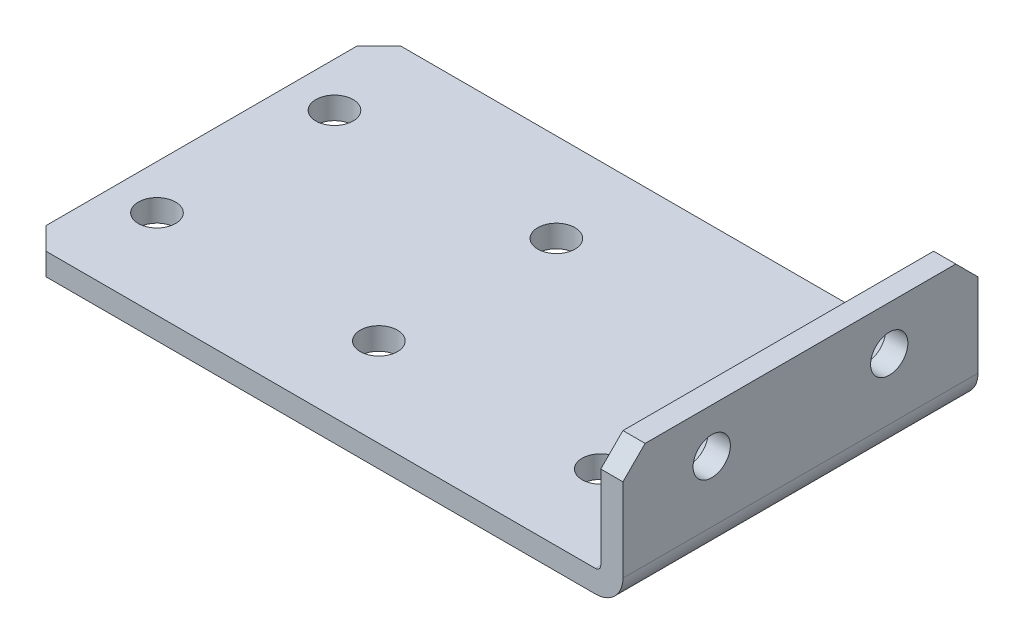
ISO-10303-21;
HEADER;
FILE_DESCRIPTION(('STEP AP214'),'2;1');
FILE_NAME('part.step','',(''),(''),'','','');
FILE_SCHEMA(('AUTOMOTIVE_DESIGN { 1 0 10303 214 1 1 1 1 }'));
ENDSEC;
DATA;
#1=APPLICATION_CONTEXT('core data for automotive mechanical design processes');
#2=APPLICATION_PROTOCOL_DEFINITION('international standard','automotive_design',2000,#1);
#3=PRODUCT_CONTEXT('',#1,'mechanical');
#4=PRODUCT('Part','Part','',(#3));
#5=PRODUCT_RELATED_PRODUCT_CATEGORY('part','',(#4));
#6=PRODUCT_DEFINITION_FORMATION('','',#4);
#7=PRODUCT_DEFINITION_CONTEXT('part definition',#1,'design');
#8=PRODUCT_DEFINITION('design','',#6,#7);
#9=PRODUCT_DEFINITION_SHAPE('','',#8);
#10=(LENGTH_UNIT() NAMED_UNIT(*) SI_UNIT(.MILLI.,.METRE.));
#11=(NAMED_UNIT(*) PLANE_ANGLE_UNIT() SI_UNIT($,.RADIAN.));
#12=(NAMED_UNIT(*) SI_UNIT($,.STERADIAN.) SOLID_ANGLE_UNIT());
#13=UNCERTAINTY_MEASURE_WITH_UNIT(LENGTH_MEASURE(1.E-05),#10,'distance_accuracy_value','');
#14=(GEOMETRIC_REPRESENTATION_CONTEXT(3) GLOBAL_UNCERTAINTY_ASSIGNED_CONTEXT((#13)) GLOBAL_UNIT_ASSIGNED_CONTEXT((#10,
#11,#12)) REPRESENTATION_CONTEXT('',''));
#15=CARTESIAN_POINT('',(0.,0.,0.));
#16=DIRECTION('',(0.,0.,1.));
#17=DIRECTION('',(1.,0.,0.));
#18=AXIS2_PLACEMENT_3D('',#15,#16,#17);
#19=CARTESIAN_POINT('',(0.,3.175,-63.5));
#20=DIRECTION('',(0.,0.,1.));
#21=DIRECTION('',(-1.,0.,0.));
#22=AXIS2_PLACEMENT_3D('',#19,#20,#21);
#23=PLANE('',#22);
#24=DIRECTION('',(1.,0.,0.));
#25=VECTOR('',#24,1.);
#26=CARTESIAN_POINT('',(0.,0.,-63.5));
#27=LINE('',#26,#25);
#28=CARTESIAN_POINT('',(81.788,0.,-63.5));
#29=VERTEX_POINT('',#28);
#30=CARTESIAN_POINT('',(3.17500000000001,0.,-63.5));
#31=VERTEX_POINT('',#30);
#32=EDGE_CURVE('E164',#29,#31,#27,.F.);
#33=ORIENTED_EDGE('',*,*,#32,.T.);
#34=DIRECTION('',(0.,-1.,0.));
#35=VECTOR('',#34,1.);
#36=CARTESIAN_POINT('',(3.17500000000001,3.175,-63.5));
#37=LINE('',#36,#35);
#38=CARTESIAN_POINT('',(3.17500000000001,3.175,-63.5));
#39=VERTEX_POINT('',#38);
#40=EDGE_CURVE('E193',#31,#39,#37,.F.);
#41=ORIENTED_EDGE('',*,*,#40,.T.);
#42=DIRECTION('',(-1.,0.,0.));
#43=VECTOR('',#42,1.);
#44=CARTESIAN_POINT('',(0.,3.175,-63.5));
#45=LINE('',#44,#43);
#46=CARTESIAN_POINT('',(81.788,3.175,-63.5));
#47=VERTEX_POINT('',#46);
#48=EDGE_CURVE('E177',#47,#39,#45,.T.);
#49=ORIENTED_EDGE('',*,*,#48,.F.);
#50=DIRECTION('',(0.,1.,0.));
#51=VECTOR('',#50,1.);
#52=CARTESIAN_POINT('',(81.788,3.175,-63.5));
#53=LINE('',#52,#51);
#54=EDGE_CURVE('E173',#29,#47,#53,.T.);
#55=ORIENTED_EDGE('',*,*,#54,.F.);
#56=EDGE_LOOP('',(#33,#41,#49,#55));
#57=FACE_BOUND('',#56,.T.);
#58=ADVANCED_FACE('F54',(#57),#23,.F.);
#59=CARTESIAN_POINT('',(0.,3.175,0.));
#60=DIRECTION('',(1.,0.,0.));
#61=DIRECTION('',(0.,0.,1.));
#62=AXIS2_PLACEMENT_3D('',#59,#60,#61);
#63=PLANE('',#62);
#64=DIRECTION('',(0.,0.,1.));
#65=VECTOR('',#64,1.);
#66=CARTESIAN_POINT('',(0.,3.175,0.));
#67=LINE('',#66,#65);
#68=CARTESIAN_POINT('',(0.,3.175,-60.325));
#69=VERTEX_POINT('',#68);
#70=CARTESIAN_POINT('',(0.,3.175,-15.875));
#71=VERTEX_POINT('',#70);
#72=EDGE_CURVE('E168',#69,#71,#67,.T.);
#73=ORIENTED_EDGE('',*,*,#72,.F.);
#74=DIRECTION('',(0.,1.,0.));
#75=VECTOR('',#74,1.);
#76=CARTESIAN_POINT('',(0.,3.175,-60.325));
#77=LINE('',#76,#75);
#78=CARTESIAN_POINT('',(0.,0.,-60.325));
#79=VERTEX_POINT('',#78);
#80=EDGE_CURVE('E202',#69,#79,#77,.F.);
#81=ORIENTED_EDGE('',*,*,#80,.T.);
#82=DIRECTION('',(0.,0.,-1.));
#83=VECTOR('',#82,1.);
#84=CARTESIAN_POINT('',(0.,0.,-63.5));
#85=LINE('',#84,#83);
#86=CARTESIAN_POINT('',(0.,0.,-15.875));
#87=VERTEX_POINT('',#86);
#88=EDGE_CURVE('E166',#79,#87,#85,.F.);
#89=ORIENTED_EDGE('',*,*,#88,.T.);
#90=DIRECTION('',(0.,-1.,0.));
#91=VECTOR('',#90,1.);
#92=CARTESIAN_POINT('',(0.,3.175,-15.875));
#93=LINE('',#92,#91);
#94=EDGE_CURVE('E200',#87,#71,#93,.F.);
#95=ORIENTED_EDGE('',*,*,#94,.T.);
#96=EDGE_LOOP('',(#73,#81,#89,#95));
#97=FACE_BOUND('',#96,.T.);
#98=ADVANCED_FACE('F221',(#97),#63,.F.);
#99=CARTESIAN_POINT('',(0.,3.175,-63.5));
#100=DIRECTION('',(0.,-1.,0.));
#101=DIRECTION('',(0.,0.,-1.));
#102=AXIS2_PLACEMENT_3D('',#99,#100,#101);
#103=PLANE('',#102);
#104=CARTESIAN_POINT('',(38.1,3.175,-25.4));
#105=DIRECTION('',(0.,1.,0.));
#106=DIRECTION('',(0.,0.,1.));
#107=AXIS2_PLACEMENT_3D('',#104,#105,#106);
#108=CIRCLE('',#107,2.667);
#109=CARTESIAN_POINT('',(38.1,3.175,-22.733));
#110=VERTEX_POINT('',#109);
#111=EDGE_CURVE('E280',#110,#110,#108,.T.);
#112=ORIENTED_EDGE('',*,*,#111,.F.);
#113=EDGE_LOOP('',(#112));
#114=FACE_BOUND('',#113,.T.);
#115=CARTESIAN_POINT('',(38.1,3.175,-50.8));
#116=DIRECTION('',(0.,1.,0.));
#117=DIRECTION('',(0.,0.,1.));
#118=AXIS2_PLACEMENT_3D('',#115,#116,#117);
#119=CIRCLE('',#118,2.667);
#120=CARTESIAN_POINT('',(38.1,3.175,-48.133));
#121=VERTEX_POINT('',#120);
#122=EDGE_CURVE('E274',#121,#121,#119,.T.);
#123=ORIENTED_EDGE('',*,*,#122,.F.);
#124=EDGE_LOOP('',(#123));
#125=FACE_BOUND('',#124,.T.);
#126=CARTESIAN_POINT('',(69.85,3.175,-25.4));
#127=DIRECTION('',(0.,1.,0.));
#128=DIRECTION('',(0.,0.,1.));
#129=AXIS2_PLACEMENT_3D('',#126,#127,#128);
#130=CIRCLE('',#129,2.667);
#131=CARTESIAN_POINT('',(69.85,3.175,-22.733));
#132=VERTEX_POINT('',#131);
#133=EDGE_CURVE('E268',#132,#132,#130,.T.);
#134=ORIENTED_EDGE('',*,*,#133,.F.);
#135=EDGE_LOOP('',(#134));
#136=FACE_BOUND('',#135,.T.);
#137=CARTESIAN_POINT('',(69.85,3.175,-50.8));
#138=DIRECTION('',(0.,1.,0.));
#139=DIRECTION('',(0.,0.,1.));
#140=AXIS2_PLACEMENT_3D('',#137,#138,#139);
#141=CIRCLE('',#140,2.667);
#142=CARTESIAN_POINT('',(69.85,3.175,-48.133));
#143=VERTEX_POINT('',#142);
#144=EDGE_CURVE('E262',#143,#143,#141,.T.);
#145=ORIENTED_EDGE('',*,*,#144,.F.);
#146=EDGE_LOOP('',(#145));
#147=FACE_BOUND('',#146,.T.);
#148=CARTESIAN_POINT('',(6.35,3.175,-25.4));
#149=DIRECTION('',(0.,1.,0.));
#150=DIRECTION('',(0.,0.,1.));
#151=AXIS2_PLACEMENT_3D('',#148,#149,#150);
#152=CIRCLE('',#151,2.667);
#153=CARTESIAN_POINT('',(6.35,3.175,-22.733));
#154=VERTEX_POINT('',#153);
#155=EDGE_CURVE('E256',#154,#154,#152,.T.);
#156=ORIENTED_EDGE('',*,*,#155,.F.);
#157=EDGE_LOOP('',(#156));
#158=FACE_BOUND('',#157,.T.);
#159=CARTESIAN_POINT('',(6.34999999999999,3.175,-50.8));
#160=DIRECTION('',(0.,1.,0.));
#161=DIRECTION('',(0.,0.,1.));
#162=AXIS2_PLACEMENT_3D('',#159,#160,#161);
#163=CIRCLE('',#162,2.667);
#164=CARTESIAN_POINT('',(6.34999999999999,3.175,-48.133));
#165=VERTEX_POINT('',#164);
#166=EDGE_CURVE('E250',#165,#165,#163,.T.);
#167=ORIENTED_EDGE('',*,*,#166,.F.);
#168=EDGE_LOOP('',(#167));
#169=FACE_BOUND('',#168,.T.);
#170=ORIENTED_EDGE('',*,*,#48,.T.);
#171=DIRECTION('',(0.707106781186548,0.,-0.707106781186548));
#172=VECTOR('',#171,1.);
#173=CARTESIAN_POINT('',(3.17500000000001,3.175,-63.5));
#174=LINE('',#173,#172);
#175=EDGE_CURVE('E198',#39,#69,#174,.F.);
#176=ORIENTED_EDGE('',*,*,#175,.T.);
#177=ORIENTED_EDGE('',*,*,#72,.T.);
#178=DIRECTION('',(-0.707106781186548,0.,-0.707106781186547));
#179=VECTOR('',#178,1.);
#180=CARTESIAN_POINT('',(3.17500000000001,3.175,-12.7));
#181=LINE('',#180,#179);
#182=CARTESIAN_POINT('',(3.17500000000001,3.175,-12.7));
#183=VERTEX_POINT('',#182);
#184=EDGE_CURVE('E196',#71,#183,#181,.F.);
#185=ORIENTED_EDGE('',*,*,#184,.T.);
#186=DIRECTION('',(1.,0.,0.));
#187=VECTOR('',#186,1.);
#188=CARTESIAN_POINT('',(0.,3.175,-12.7));
#189=LINE('',#188,#187);
#190=CARTESIAN_POINT('',(81.788,3.175,-12.7));
#191=VERTEX_POINT('',#190);
#192=EDGE_CURVE('E297',#183,#191,#189,.T.);
#193=ORIENTED_EDGE('',*,*,#192,.T.);
#194=DIRECTION('',(0.,0.,-1.));
#195=VECTOR('',#194,1.);
#196=CARTESIAN_POINT('',(81.788,3.175,0.));
#197=LINE('',#196,#195);
#198=EDGE_CURVE('E222',#191,#47,#197,.T.);
#199=ORIENTED_EDGE('',*,*,#198,.T.);
#200=EDGE_LOOP('',(#170,#176,#177,#185,#193,#199));
#201=FACE_BOUND('',#200,.T.);
#202=ADVANCED_FACE('F218',(#114,#125,#136,#147,#158,#169,#201),#103,.F.);
#203=CARTESIAN_POINT('',(0.,0.,-63.5));
#204=DIRECTION('',(0.,-1.,0.));
#205=DIRECTION('',(0.,0.,-1.));
#206=AXIS2_PLACEMENT_3D('',#203,#204,#205);
#207=PLANE('',#206);
#208=ORIENTED_EDGE('',*,*,#88,.F.);
#209=DIRECTION('',(-0.707106781186548,0.,0.707106781186548));
#210=VECTOR('',#209,1.);
#211=CARTESIAN_POINT('',(1.58750000000001,0.,-61.9125));
#212=LINE('',#211,#210);
#213=EDGE_CURVE('E205',#79,#31,#212,.F.);
#214=ORIENTED_EDGE('',*,*,#213,.T.);
#215=ORIENTED_EDGE('',*,*,#32,.F.);
#216=DIRECTION('',(0.,0.,-1.));
#217=VECTOR('',#216,1.);
#218=CARTESIAN_POINT('',(81.788,0.,-63.5));
#219=LINE('',#218,#217);
#220=CARTESIAN_POINT('',(81.788,0.,-12.7));
#221=VERTEX_POINT('',#220);
#222=EDGE_CURVE('E154',#221,#29,#219,.T.);
#223=ORIENTED_EDGE('',*,*,#222,.F.);
#224=DIRECTION('',(-1.,0.,0.));
#225=VECTOR('',#224,1.);
#226=CARTESIAN_POINT('',(-9.42940188980387,0.,-12.7));
#227=LINE('',#226,#225);
#228=CARTESIAN_POINT('',(3.17500000000001,0.,-12.7));
#229=VERTEX_POINT('',#228);
#230=EDGE_CURVE('E142',#221,#229,#227,.T.);
#231=ORIENTED_EDGE('',*,*,#230,.T.);
#232=DIRECTION('',(0.707106781186548,0.,0.707106781186547));
#233=VECTOR('',#232,1.);
#234=CARTESIAN_POINT('',(-23.8125,0.,-39.6875));
#235=LINE('',#234,#233);
#236=EDGE_CURVE('E69',#229,#87,#235,.F.);
#237=ORIENTED_EDGE('',*,*,#236,.T.);
#238=EDGE_LOOP('',(#208,#214,#215,#223,#231,#237));
#239=FACE_BOUND('',#238,.T.);
#240=CARTESIAN_POINT('',(38.1,0.,-25.4));
#241=DIRECTION('',(0.,1.,0.));
#242=DIRECTION('',(0.,0.,1.));
#243=AXIS2_PLACEMENT_3D('',#240,#241,#242);
#244=CIRCLE('',#243,2.667);
#245=CARTESIAN_POINT('',(38.1,0.,-22.733));
#246=VERTEX_POINT('',#245);
#247=EDGE_CURVE('E277',#246,#246,#244,.T.);
#248=ORIENTED_EDGE('',*,*,#247,.T.);
#249=EDGE_LOOP('',(#248));
#250=FACE_BOUND('',#249,.T.);
#251=CARTESIAN_POINT('',(38.1,0.,-50.8));
#252=DIRECTION('',(0.,1.,0.));
#253=DIRECTION('',(0.,0.,1.));
#254=AXIS2_PLACEMENT_3D('',#251,#252,#253);
#255=CIRCLE('',#254,2.667);
#256=CARTESIAN_POINT('',(38.1,0.,-48.133));
#257=VERTEX_POINT('',#256);
#258=EDGE_CURVE('E271',#257,#257,#255,.T.);
#259=ORIENTED_EDGE('',*,*,#258,.T.);
#260=EDGE_LOOP('',(#259));
#261=FACE_BOUND('',#260,.T.);
#262=CARTESIAN_POINT('',(69.85,0.,-25.4));
#263=DIRECTION('',(0.,1.,0.));
#264=DIRECTION('',(0.,0.,1.));
#265=AXIS2_PLACEMENT_3D('',#262,#263,#264);
#266=CIRCLE('',#265,2.667);
#267=CARTESIAN_POINT('',(69.85,0.,-22.733));
#268=VERTEX_POINT('',#267);
#269=EDGE_CURVE('E265',#268,#268,#266,.T.);
#270=ORIENTED_EDGE('',*,*,#269,.T.);
#271=EDGE_LOOP('',(#270));
#272=FACE_BOUND('',#271,.T.);
#273=CARTESIAN_POINT('',(69.85,0.,-50.8));
#274=DIRECTION('',(0.,1.,0.));
#275=DIRECTION('',(0.,0.,1.));
#276=AXIS2_PLACEMENT_3D('',#273,#274,#275);
#277=CIRCLE('',#276,2.667);
#278=CARTESIAN_POINT('',(69.85,0.,-48.133));
#279=VERTEX_POINT('',#278);
#280=EDGE_CURVE('E259',#279,#279,#277,.T.);
#281=ORIENTED_EDGE('',*,*,#280,.T.);
#282=EDGE_LOOP('',(#281));
#283=FACE_BOUND('',#282,.T.);
#284=CARTESIAN_POINT('',(6.35,0.,-25.4));
#285=DIRECTION('',(0.,1.,0.));
#286=DIRECTION('',(0.,0.,1.));
#287=AXIS2_PLACEMENT_3D('',#284,#285,#286);
#288=CIRCLE('',#287,2.667);
#289=CARTESIAN_POINT('',(6.35,0.,-22.733));
#290=VERTEX_POINT('',#289);
#291=EDGE_CURVE('E253',#290,#290,#288,.T.);
#292=ORIENTED_EDGE('',*,*,#291,.T.);
#293=EDGE_LOOP('',(#292));
#294=FACE_BOUND('',#293,.T.);
#295=CARTESIAN_POINT('',(6.34999999999999,0.,-50.8));
#296=DIRECTION('',(0.,1.,0.));
#297=DIRECTION('',(0.,0.,1.));
#298=AXIS2_PLACEMENT_3D('',#295,#296,#297);
#299=CIRCLE('',#298,2.667);
#300=CARTESIAN_POINT('',(6.34999999999999,0.,-48.133));
#301=VERTEX_POINT('',#300);
#302=EDGE_CURVE('E235',#301,#301,#299,.T.);
#303=ORIENTED_EDGE('',*,*,#302,.T.);
#304=EDGE_LOOP('',(#303));
#305=FACE_BOUND('',#304,.T.);
#306=ADVANCED_FACE('F161',(#239,#250,#261,#272,#283,#294,#305),#207,.T.);
#307=CARTESIAN_POINT('',(81.788,3.937,-63.5));
#308=DIRECTION('',(0.,0.,1.));
#309=DIRECTION('',(1.,0.,0.));
#310=AXIS2_PLACEMENT_3D('',#307,#308,#309);
#311=PLANE('',#310);
#312=CARTESIAN_POINT('',(81.788,3.937,-63.5));
#313=DIRECTION('',(0.,0.,-1.));
#314=DIRECTION('',(-1.,0.,0.));
#315=AXIS2_PLACEMENT_3D('',#312,#313,#314);
#316=CIRCLE('',#315,0.761999999999999);
#317=CARTESIAN_POINT('',(82.55,3.937,-63.5));
#318=VERTEX_POINT('',#317);
#319=EDGE_CURVE('E226',#318,#47,#316,.T.);
#320=ORIENTED_EDGE('',*,*,#319,.F.);
#321=DIRECTION('',(-1.,0.,0.));
#322=VECTOR('',#321,1.);
#323=CARTESIAN_POINT('',(82.55,3.937,-63.5));
#324=LINE('',#323,#322);
#325=CARTESIAN_POINT('',(85.725,3.93699999999999,-63.5));
#326=VERTEX_POINT('',#325);
#327=EDGE_CURVE('E234',#318,#326,#324,.F.);
#328=ORIENTED_EDGE('',*,*,#327,.T.);
#329=CARTESIAN_POINT('',(81.788,3.937,-63.5));
#330=DIRECTION('',(0.,0.,-1.));
#331=DIRECTION('',(-1.,0.,0.));
#332=AXIS2_PLACEMENT_3D('',#329,#330,#331);
#333=CIRCLE('',#332,3.937);
#334=EDGE_CURVE('E170',#326,#29,#333,.T.);
#335=ORIENTED_EDGE('',*,*,#334,.T.);
#336=ORIENTED_EDGE('',*,*,#54,.T.);
#337=EDGE_LOOP('',(#320,#328,#335,#336));
#338=FACE_BOUND('',#337,.T.);
#339=ADVANCED_FACE('F398',(#338),#311,.F.);
#340=CARTESIAN_POINT('',(81.788,3.937,-63.5));
#341=DIRECTION('',(0.,0.,-1.));
#342=DIRECTION('',(1.,0.,0.));
#343=AXIS2_PLACEMENT_3D('',#340,#341,#342);
#344=CYLINDRICAL_SURFACE('',#343,3.937);
#345=CARTESIAN_POINT('',(81.788,3.937,-12.7));
#346=DIRECTION('',(0.,0.,-1.));
#347=DIRECTION('',(-1.,0.,0.));
#348=AXIS2_PLACEMENT_3D('',#345,#346,#347);
#349=CIRCLE('',#348,3.937);
#350=CARTESIAN_POINT('',(85.725,3.93699999999999,-12.7));
#351=VERTEX_POINT('',#350);
#352=EDGE_CURVE('E146',#221,#351,#349,.F.);
#353=ORIENTED_EDGE('',*,*,#352,.F.);
#354=ORIENTED_EDGE('',*,*,#222,.T.);
#355=ORIENTED_EDGE('',*,*,#334,.F.);
#356=DIRECTION('',(0.,0.,-1.));
#357=VECTOR('',#356,1.);
#358=CARTESIAN_POINT('',(85.725,3.93699999999998,0.));
#359=LINE('',#358,#357);
#360=EDGE_CURVE('E157',#326,#351,#359,.F.);
#361=ORIENTED_EDGE('',*,*,#360,.T.);
#362=EDGE_LOOP('',(#353,#354,#355,#361));
#363=FACE_BOUND('',#362,.T.);
#364=ADVANCED_FACE('F153',(#363),#344,.T.);
#365=CARTESIAN_POINT('',(81.788,3.937,-63.5));
#366=DIRECTION('',(0.,0.,-1.));
#367=DIRECTION('',(1.,0.,0.));
#368=AXIS2_PLACEMENT_3D('',#365,#366,#367);
#369=CYLINDRICAL_SURFACE('',#368,0.761999999999999);
#370=ORIENTED_EDGE('',*,*,#198,.F.);
#371=CARTESIAN_POINT('',(81.788,3.937,-12.7));
#372=DIRECTION('',(0.,0.,-1.));
#373=DIRECTION('',(-1.,0.,0.));
#374=AXIS2_PLACEMENT_3D('',#371,#372,#373);
#375=CIRCLE('',#374,0.761999999999999);
#376=CARTESIAN_POINT('',(82.55,3.937,-12.7));
#377=VERTEX_POINT('',#376);
#378=EDGE_CURVE('E299',#191,#377,#375,.F.);
#379=ORIENTED_EDGE('',*,*,#378,.T.);
#380=DIRECTION('',(0.,0.,-1.));
#381=VECTOR('',#380,1.);
#382=CARTESIAN_POINT('',(82.55,3.937,0.));
#383=LINE('',#382,#381);
#384=EDGE_CURVE('E232',#377,#318,#383,.T.);
#385=ORIENTED_EDGE('',*,*,#384,.T.);
#386=ORIENTED_EDGE('',*,*,#319,.T.);
#387=EDGE_LOOP('',(#370,#379,#385,#386));
#388=FACE_BOUND('',#387,.T.);
#389=ADVANCED_FACE('F310',(#388),#369,.F.);
#390=CARTESIAN_POINT('',(85.7250000000001,19.05,-63.5));
#391=DIRECTION('',(0.,0.,1.));
#392=DIRECTION('',(1.,0.,0.));
#393=AXIS2_PLACEMENT_3D('',#390,#391,#392);
#394=PLANE('',#393);
#395=DIRECTION('',(0.,-1.,0.));
#396=VECTOR('',#395,1.);
#397=CARTESIAN_POINT('',(82.5500000000001,19.05,-63.5));
#398=LINE('',#397,#396);
#399=CARTESIAN_POINT('',(82.55,15.875,-63.5));
#400=VERTEX_POINT('',#399);
#401=EDGE_CURVE('E239',#318,#400,#398,.F.);
#402=ORIENTED_EDGE('',*,*,#401,.T.);
#403=DIRECTION('',(1.,0.,0.));
#404=VECTOR('',#403,1.);
#405=CARTESIAN_POINT('',(85.725,15.875,-63.5));
#406=LINE('',#405,#404);
#407=CARTESIAN_POINT('',(85.725,15.875,-63.5));
#408=VERTEX_POINT('',#407);
#409=EDGE_CURVE('E187',#400,#408,#406,.T.);
#410=ORIENTED_EDGE('',*,*,#409,.T.);
#411=DIRECTION('',(0.,1.,0.));
#412=VECTOR('',#411,1.);
#413=CARTESIAN_POINT('',(85.7250000000001,19.05,-63.5));
#414=LINE('',#413,#412);
#415=EDGE_CURVE('E245',#326,#408,#414,.T.);
#416=ORIENTED_EDGE('',*,*,#415,.F.);
#417=ORIENTED_EDGE('',*,*,#327,.F.);
#418=EDGE_LOOP('',(#402,#410,#416,#417));
#419=FACE_BOUND('',#418,.T.);
#420=ADVANCED_FACE('F319',(#419),#394,.F.);
#421=CARTESIAN_POINT('',(85.7250000000001,19.05,0.));
#422=DIRECTION('',(-1.,0.,0.));
#423=DIRECTION('',(0.,-1.,0.));
#424=AXIS2_PLACEMENT_3D('',#421,#422,#423);
#425=PLANE('',#424);
#426=CARTESIAN_POINT('',(85.7250000000001,12.7000000000001,-25.4));
#427=DIRECTION('',(-1.,0.,0.));
#428=DIRECTION('',(0.,-1.,0.));
#429=AXIS2_PLACEMENT_3D('',#426,#427,#428);
#430=CIRCLE('',#429,2.667);
#431=CARTESIAN_POINT('',(85.7250000000001,10.0330000000001,-25.4));
#432=VERTEX_POINT('',#431);
#433=EDGE_CURVE('E289',#432,#432,#430,.T.);
#434=ORIENTED_EDGE('',*,*,#433,.T.);
#435=EDGE_LOOP('',(#434));
#436=FACE_BOUND('',#435,.T.);
#437=CARTESIAN_POINT('',(85.7250000000001,12.7000000000001,-50.8));
#438=DIRECTION('',(-1.,0.,0.));
#439=DIRECTION('',(0.,-1.,0.));
#440=AXIS2_PLACEMENT_3D('',#437,#438,#439);
#441=CIRCLE('',#440,2.667);
#442=CARTESIAN_POINT('',(85.7250000000001,10.0330000000001,-50.8));
#443=VERTEX_POINT('',#442);
#444=EDGE_CURVE('E283',#443,#443,#441,.T.);
#445=ORIENTED_EDGE('',*,*,#444,.T.);
#446=EDGE_LOOP('',(#445));
#447=FACE_BOUND('',#446,.T.);
#448=ORIENTED_EDGE('',*,*,#415,.T.);
#449=DIRECTION('',(0.,-0.707106781186548,-0.707106781186548));
#450=VECTOR('',#449,1.);
#451=CARTESIAN_POINT('',(85.7250000000001,19.05,-60.325));
#452=LINE('',#451,#450);
#453=CARTESIAN_POINT('',(85.7250000000001,19.05,-60.325));
#454=VERTEX_POINT('',#453);
#455=EDGE_CURVE('E191',#408,#454,#452,.F.);
#456=ORIENTED_EDGE('',*,*,#455,.T.);
#457=DIRECTION('',(0.,0.,1.));
#458=VECTOR('',#457,1.);
#459=CARTESIAN_POINT('',(85.7250000000001,19.05,0.));
#460=LINE('',#459,#458);
#461=CARTESIAN_POINT('',(85.7250000000001,19.05,-15.875));
#462=VERTEX_POINT('',#461);
#463=EDGE_CURVE('E230',#454,#462,#460,.T.);
#464=ORIENTED_EDGE('',*,*,#463,.T.);
#465=DIRECTION('',(0.,0.707106781186549,-0.707106781186546));
#466=VECTOR('',#465,1.);
#467=CARTESIAN_POINT('',(85.7250000000001,19.05,-15.875));
#468=LINE('',#467,#466);
#469=CARTESIAN_POINT('',(85.725,15.875,-12.7));
#470=VERTEX_POINT('',#469);
#471=EDGE_CURVE('E189',#462,#470,#468,.F.);
#472=ORIENTED_EDGE('',*,*,#471,.T.);
#473=DIRECTION('',(0.,-1.,0.));
#474=VECTOR('',#473,1.);
#475=CARTESIAN_POINT('',(85.7250000000001,19.05,-12.7));
#476=LINE('',#475,#474);
#477=EDGE_CURVE('E159',#470,#351,#476,.T.);
#478=ORIENTED_EDGE('',*,*,#477,.T.);
#479=ORIENTED_EDGE('',*,*,#360,.F.);
#480=EDGE_LOOP('',(#448,#456,#464,#472,#478,#479));
#481=FACE_BOUND('',#480,.T.);
#482=ADVANCED_FACE('F327',(#436,#447,#481),#425,.F.);
#483=CARTESIAN_POINT('',(82.5500000000001,19.05,0.));
#484=DIRECTION('',(-1.,0.,0.));
#485=DIRECTION('',(0.,-1.,0.));
#486=AXIS2_PLACEMENT_3D('',#483,#484,#485);
#487=PLANE('',#486);
#488=DIRECTION('',(0.,0.,-1.));
#489=VECTOR('',#488,1.);
#490=CARTESIAN_POINT('',(82.5500000000001,19.05,0.));
#491=LINE('',#490,#489);
#492=CARTESIAN_POINT('',(82.5500000000001,19.05,-60.325));
#493=VERTEX_POINT('',#492);
#494=CARTESIAN_POINT('',(82.5500000000001,19.05,-15.875));
#495=VERTEX_POINT('',#494);
#496=EDGE_CURVE('E242',#493,#495,#491,.F.);
#497=ORIENTED_EDGE('',*,*,#496,.F.);
#498=DIRECTION('',(0.,0.707106781186548,0.707106781186548));
#499=VECTOR('',#498,1.);
#500=CARTESIAN_POINT('',(82.5500000000002,49.2125,-30.1625));
#501=LINE('',#500,#499);
#502=EDGE_CURVE('E185',#493,#400,#501,.F.);
#503=ORIENTED_EDGE('',*,*,#502,.T.);
#504=ORIENTED_EDGE('',*,*,#401,.F.);
#505=ORIENTED_EDGE('',*,*,#384,.F.);
#506=DIRECTION('',(0.,-1.,0.));
#507=VECTOR('',#506,1.);
#508=CARTESIAN_POINT('',(82.5500000000001,19.05,-12.7));
#509=LINE('',#508,#507);
#510=CARTESIAN_POINT('',(82.55,15.875,-12.7));
#511=VERTEX_POINT('',#510);
#512=EDGE_CURVE('E150',#511,#377,#509,.T.);
#513=ORIENTED_EDGE('',*,*,#512,.F.);
#514=DIRECTION('',(0.,-0.707106781186549,0.707106781186546));
#515=VECTOR('',#514,1.);
#516=CARTESIAN_POINT('',(82.55,11.1125,-7.93750000000004));
#517=LINE('',#516,#515);
#518=EDGE_CURVE('E183',#511,#495,#517,.F.);
#519=ORIENTED_EDGE('',*,*,#518,.T.);
#520=EDGE_LOOP('',(#497,#503,#504,#505,#513,#519));
#521=FACE_BOUND('',#520,.T.);
#522=CARTESIAN_POINT('',(82.55,12.7000000000001,-25.4));
#523=DIRECTION('',(-1.,0.,0.));
#524=DIRECTION('',(0.,-1.,0.));
#525=AXIS2_PLACEMENT_3D('',#522,#523,#524);
#526=CIRCLE('',#525,2.667);
#527=CARTESIAN_POINT('',(82.55,10.0330000000001,-25.4));
#528=VERTEX_POINT('',#527);
#529=EDGE_CURVE('E158',#528,#528,#526,.T.);
#530=ORIENTED_EDGE('',*,*,#529,.F.);
#531=EDGE_LOOP('',(#530));
#532=FACE_BOUND('',#531,.T.);
#533=CARTESIAN_POINT('',(82.55,12.7000000000001,-50.8));
#534=DIRECTION('',(-1.,0.,0.));
#535=DIRECTION('',(0.,-1.,0.));
#536=AXIS2_PLACEMENT_3D('',#533,#534,#535);
#537=CIRCLE('',#536,2.667);
#538=CARTESIAN_POINT('',(82.55,10.0330000000001,-50.8));
#539=VERTEX_POINT('',#538);
#540=EDGE_CURVE('E286',#539,#539,#537,.T.);
#541=ORIENTED_EDGE('',*,*,#540,.F.);
#542=EDGE_LOOP('',(#541));
#543=FACE_BOUND('',#542,.T.);
#544=ADVANCED_FACE('F314',(#521,#532,#543),#487,.T.);
#545=CARTESIAN_POINT('',(85.7250000000001,19.05,0.));
#546=DIRECTION('',(0.,-1.,0.));
#547=DIRECTION('',(1.,0.,0.));
#548=AXIS2_PLACEMENT_3D('',#545,#546,#547);
#549=PLANE('',#548);
#550=ORIENTED_EDGE('',*,*,#463,.F.);
#551=DIRECTION('',(-1.,0.,0.));
#552=VECTOR('',#551,1.);
#553=CARTESIAN_POINT('',(85.7250000000001,19.05,-60.325));
#554=LINE('',#553,#552);
#555=EDGE_CURVE('E180',#454,#493,#554,.T.);
#556=ORIENTED_EDGE('',*,*,#555,.T.);
#557=ORIENTED_EDGE('',*,*,#496,.T.);
#558=DIRECTION('',(1.,0.,0.));
#559=VECTOR('',#558,1.);
#560=CARTESIAN_POINT('',(85.7250000000001,19.05,-15.875));
#561=LINE('',#560,#559);
#562=EDGE_CURVE('E176',#495,#462,#561,.T.);
#563=ORIENTED_EDGE('',*,*,#562,.T.);
#564=EDGE_LOOP('',(#550,#556,#557,#563));
#565=FACE_BOUND('',#564,.T.);
#566=ADVANCED_FACE('F329',(#565),#549,.F.);
#567=CARTESIAN_POINT('',(6.34999999999999,0.,-50.8));
#568=DIRECTION('',(0.,1.,0.));
#569=DIRECTION('',(0.,0.,1.));
#570=AXIS2_PLACEMENT_3D('',#567,#568,#569);
#571=CYLINDRICAL_SURFACE('',#570,2.667);
#572=ORIENTED_EDGE('',*,*,#302,.F.);
#573=EDGE_LOOP('',(#572));
#574=FACE_BOUND('',#573,.T.);
#575=ORIENTED_EDGE('',*,*,#166,.T.);
#576=EDGE_LOOP('',(#575));
#577=FACE_BOUND('',#576,.T.);
#578=ADVANCED_FACE('F382',(#574,#577),#571,.F.);
#579=CARTESIAN_POINT('',(6.35,0.,-25.4));
#580=DIRECTION('',(0.,1.,0.));
#581=DIRECTION('',(0.,0.,1.));
#582=AXIS2_PLACEMENT_3D('',#579,#580,#581);
#583=CYLINDRICAL_SURFACE('',#582,2.667);
#584=ORIENTED_EDGE('',*,*,#291,.F.);
#585=EDGE_LOOP('',(#584));
#586=FACE_BOUND('',#585,.T.);
#587=ORIENTED_EDGE('',*,*,#155,.T.);
#588=EDGE_LOOP('',(#587));
#589=FACE_BOUND('',#588,.T.);
#590=ADVANCED_FACE('F378',(#586,#589),#583,.F.);
#591=CARTESIAN_POINT('',(69.85,0.,-50.8));
#592=DIRECTION('',(0.,1.,0.));
#593=DIRECTION('',(0.,0.,1.));
#594=AXIS2_PLACEMENT_3D('',#591,#592,#593);
#595=CYLINDRICAL_SURFACE('',#594,2.667);
#596=ORIENTED_EDGE('',*,*,#280,.F.);
#597=EDGE_LOOP('',(#596));
#598=FACE_BOUND('',#597,.T.);
#599=ORIENTED_EDGE('',*,*,#144,.T.);
#600=EDGE_LOOP('',(#599));
#601=FACE_BOUND('',#600,.T.);
#602=ADVANCED_FACE('F374',(#598,#601),#595,.F.);
#603=CARTESIAN_POINT('',(69.85,0.,-25.4));
#604=DIRECTION('',(0.,1.,0.));
#605=DIRECTION('',(0.,0.,1.));
#606=AXIS2_PLACEMENT_3D('',#603,#604,#605);
#607=CYLINDRICAL_SURFACE('',#606,2.667);
#608=ORIENTED_EDGE('',*,*,#269,.F.);
#609=EDGE_LOOP('',(#608));
#610=FACE_BOUND('',#609,.T.);
#611=ORIENTED_EDGE('',*,*,#133,.T.);
#612=EDGE_LOOP('',(#611));
#613=FACE_BOUND('',#612,.T.);
#614=ADVANCED_FACE('F370',(#610,#613),#607,.F.);
#615=CARTESIAN_POINT('',(38.1,0.,-50.8));
#616=DIRECTION('',(0.,1.,0.));
#617=DIRECTION('',(0.,0.,1.));
#618=AXIS2_PLACEMENT_3D('',#615,#616,#617);
#619=CYLINDRICAL_SURFACE('',#618,2.667);
#620=ORIENTED_EDGE('',*,*,#258,.F.);
#621=EDGE_LOOP('',(#620));
#622=FACE_BOUND('',#621,.T.);
#623=ORIENTED_EDGE('',*,*,#122,.T.);
#624=EDGE_LOOP('',(#623));
#625=FACE_BOUND('',#624,.T.);
#626=ADVANCED_FACE('F366',(#622,#625),#619,.F.);
#627=CARTESIAN_POINT('',(38.1,0.,-25.4));
#628=DIRECTION('',(0.,1.,0.));
#629=DIRECTION('',(0.,0.,1.));
#630=AXIS2_PLACEMENT_3D('',#627,#628,#629);
#631=CYLINDRICAL_SURFACE('',#630,2.667);
#632=ORIENTED_EDGE('',*,*,#247,.F.);
#633=EDGE_LOOP('',(#632));
#634=FACE_BOUND('',#633,.T.);
#635=ORIENTED_EDGE('',*,*,#111,.T.);
#636=EDGE_LOOP('',(#635));
#637=FACE_BOUND('',#636,.T.);
#638=ADVANCED_FACE('F362',(#634,#637),#631,.F.);
#639=CARTESIAN_POINT('',(85.7250000000001,12.7000000000001,-50.8));
#640=DIRECTION('',(-1.,0.,0.));
#641=DIRECTION('',(0.,-1.,0.));
#642=AXIS2_PLACEMENT_3D('',#639,#640,#641);
#643=CYLINDRICAL_SURFACE('',#642,2.667);
#644=ORIENTED_EDGE('',*,*,#444,.F.);
#645=EDGE_LOOP('',(#644));
#646=FACE_BOUND('',#645,.T.);
#647=ORIENTED_EDGE('',*,*,#540,.T.);
#648=EDGE_LOOP('',(#647));
#649=FACE_BOUND('',#648,.T.);
#650=ADVANCED_FACE('F356',(#646,#649),#643,.F.);
#651=CARTESIAN_POINT('',(85.7250000000001,12.7000000000001,-25.4));
#652=DIRECTION('',(-1.,0.,0.));
#653=DIRECTION('',(0.,-1.,0.));
#654=AXIS2_PLACEMENT_3D('',#651,#652,#653);
#655=CYLINDRICAL_SURFACE('',#654,2.667);
#656=ORIENTED_EDGE('',*,*,#433,.F.);
#657=EDGE_LOOP('',(#656));
#658=FACE_BOUND('',#657,.T.);
#659=ORIENTED_EDGE('',*,*,#529,.T.);
#660=EDGE_LOOP('',(#659));
#661=FACE_BOUND('',#660,.T.);
#662=ADVANCED_FACE('F351',(#658,#661),#655,.F.);
#663=CARTESIAN_POINT('',(-9.42940188980387,0.,-12.7));
#664=DIRECTION('',(0.,0.,-1.));
#665=DIRECTION('',(-1.,0.,0.));
#666=AXIS2_PLACEMENT_3D('',#663,#664,#665);
#667=PLANE('',#666);
#668=ORIENTED_EDGE('',*,*,#477,.F.);
#669=DIRECTION('',(-1.,0.,0.));
#670=VECTOR('',#669,1.);
#671=CARTESIAN_POINT('',(-9.42940188980381,15.8750000000003,-12.7));
#672=LINE('',#671,#670);
#673=EDGE_CURVE('E13',#470,#511,#672,.T.);
#674=ORIENTED_EDGE('',*,*,#673,.T.);
#675=ORIENTED_EDGE('',*,*,#512,.T.);
#676=ORIENTED_EDGE('',*,*,#378,.F.);
#677=ORIENTED_EDGE('',*,*,#192,.F.);
#678=DIRECTION('',(0.,-1.,0.));
#679=VECTOR('',#678,1.);
#680=CARTESIAN_POINT('',(3.17500000000001,0.,-12.7));
#681=LINE('',#680,#679);
#682=EDGE_CURVE('E62',#183,#229,#681,.T.);
#683=ORIENTED_EDGE('',*,*,#682,.T.);
#684=ORIENTED_EDGE('',*,*,#230,.F.);
#685=ORIENTED_EDGE('',*,*,#352,.T.);
#686=EDGE_LOOP('',(#668,#674,#675,#676,#677,#683,#684,#685));
#687=FACE_BOUND('',#686,.T.);
#688=ADVANCED_FACE('F145',(#687),#667,.F.);
#689=CARTESIAN_POINT('',(85.7250000000001,19.05,-60.325));
#690=DIRECTION('',(0.,-0.707106781186548,0.707106781186548));
#691=DIRECTION('',(0.,-0.707106781186548,-0.707106781186548));
#692=AXIS2_PLACEMENT_3D('',#689,#690,#691);
#693=PLANE('',#692);
#694=ORIENTED_EDGE('',*,*,#455,.F.);
#695=ORIENTED_EDGE('',*,*,#409,.F.);
#696=ORIENTED_EDGE('',*,*,#502,.F.);
#697=ORIENTED_EDGE('',*,*,#555,.F.);
#698=EDGE_LOOP('',(#694,#695,#696,#697));
#699=FACE_BOUND('',#698,.T.);
#700=ADVANCED_FACE('F323',(#699),#693,.F.);
#701=CARTESIAN_POINT('',(3.17500000000001,3.175,-63.5));
#702=DIRECTION('',(0.707106781186548,0.,0.707106781186548));
#703=DIRECTION('',(0.707106781186548,0.,-0.707106781186548));
#704=AXIS2_PLACEMENT_3D('',#701,#702,#703);
#705=PLANE('',#704);
#706=ORIENTED_EDGE('',*,*,#213,.F.);
#707=ORIENTED_EDGE('',*,*,#80,.F.);
#708=ORIENTED_EDGE('',*,*,#175,.F.);
#709=ORIENTED_EDGE('',*,*,#40,.F.);
#710=EDGE_LOOP('',(#706,#707,#708,#709));
#711=FACE_BOUND('',#710,.T.);
#712=ADVANCED_FACE('F214',(#711),#705,.F.);
#713=CARTESIAN_POINT('',(85.7250000000001,19.05,-15.875));
#714=DIRECTION('',(0.,-0.707106781186546,-0.707106781186549));
#715=DIRECTION('',(0.,0.707106781186549,-0.707106781186546));
#716=AXIS2_PLACEMENT_3D('',#713,#714,#715);
#717=PLANE('',#716);
#718=ORIENTED_EDGE('',*,*,#518,.F.);
#719=ORIENTED_EDGE('',*,*,#673,.F.);
#720=ORIENTED_EDGE('',*,*,#471,.F.);
#721=ORIENTED_EDGE('',*,*,#562,.F.);
#722=EDGE_LOOP('',(#718,#719,#720,#721));
#723=FACE_BOUND('',#722,.T.);
#724=ADVANCED_FACE('F332',(#723),#717,.F.);
#725=CARTESIAN_POINT('',(3.17500000000001,0.,-12.7));
#726=DIRECTION('',(0.707106781186547,0.,-0.707106781186548));
#727=DIRECTION('',(-0.707106781186548,0.,-0.707106781186547));
#728=AXIS2_PLACEMENT_3D('',#725,#726,#727);
#729=PLANE('',#728);
#730=ORIENTED_EDGE('',*,*,#184,.F.);
#731=ORIENTED_EDGE('',*,*,#94,.F.);
#732=ORIENTED_EDGE('',*,*,#236,.F.);
#733=ORIENTED_EDGE('',*,*,#682,.F.);
#734=EDGE_LOOP('',(#730,#731,#732,#733));
#735=FACE_BOUND('',#734,.T.);
#736=ADVANCED_FACE('F56',(#735),#729,.F.);
#737=CLOSED_SHELL('',(#58,#98,#202,#306,#339,#364,#389,#420,#482,#544,#566,#578,#590,#602,#614,
#626,#638,#650,#662,#688,#700,#712,#724,#736));
#738=MANIFOLD_SOLID_BREP('B2',#737);
#739=ADVANCED_BREP_SHAPE_REPRESENTATION('',(#18,#738),#14);
#740=SHAPE_DEFINITION_REPRESENTATION(#9,#739);
ENDSEC;
END-ISO-10303-21;
